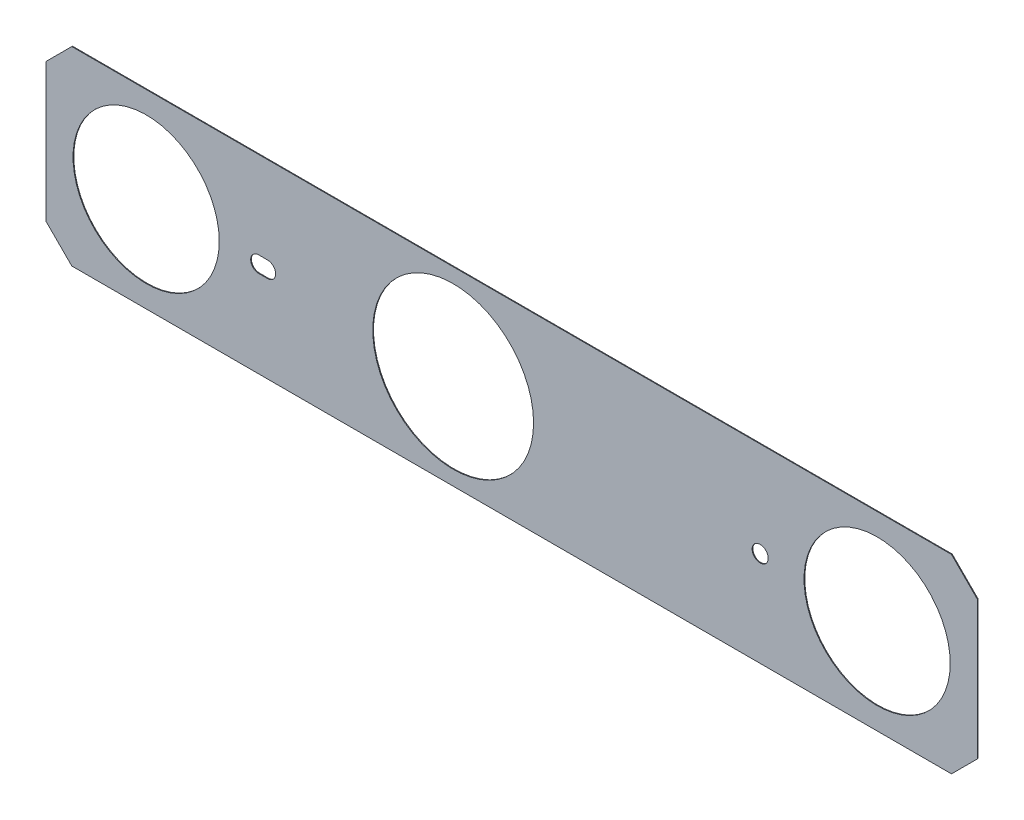
ISO-10303-21;
HEADER;
FILE_DESCRIPTION(('STEP AP214'),'2;1');
FILE_NAME('part.step','',(''),(''),'','','');
FILE_SCHEMA(('AUTOMOTIVE_DESIGN { 1 0 10303 214 1 1 1 1 }'));
ENDSEC;
DATA;
#1=APPLICATION_CONTEXT('core data for automotive mechanical design processes');
#2=APPLICATION_PROTOCOL_DEFINITION('international standard','automotive_design',2000,#1);
#3=PRODUCT_CONTEXT('',#1,'mechanical');
#4=PRODUCT('Part','Part','',(#3));
#5=PRODUCT_RELATED_PRODUCT_CATEGORY('part','',(#4));
#6=PRODUCT_DEFINITION_FORMATION('','',#4);
#7=PRODUCT_DEFINITION_CONTEXT('part definition',#1,'design');
#8=PRODUCT_DEFINITION('design','',#6,#7);
#9=PRODUCT_DEFINITION_SHAPE('','',#8);
#10=(LENGTH_UNIT() NAMED_UNIT(*) SI_UNIT(.MILLI.,.METRE.));
#11=(NAMED_UNIT(*) PLANE_ANGLE_UNIT() SI_UNIT($,.RADIAN.));
#12=(NAMED_UNIT(*) SI_UNIT($,.STERADIAN.) SOLID_ANGLE_UNIT());
#13=UNCERTAINTY_MEASURE_WITH_UNIT(LENGTH_MEASURE(1.E-05),#10,'distance_accuracy_value','');
#14=(GEOMETRIC_REPRESENTATION_CONTEXT(3) GLOBAL_UNCERTAINTY_ASSIGNED_CONTEXT((#13)) GLOBAL_UNIT_ASSIGNED_CONTEXT((#10,
#11,#12)) REPRESENTATION_CONTEXT('',''));
#15=CARTESIAN_POINT('',(0.,0.,0.));
#16=DIRECTION('',(0.,0.,1.));
#17=DIRECTION('',(1.,0.,0.));
#18=AXIS2_PLACEMENT_3D('',#15,#16,#17);
#19=CARTESIAN_POINT('',(0.,0.,-3.02));
#20=DIRECTION('',(0.,0.,1.));
#21=DIRECTION('',(1.,0.,0.));
#22=AXIS2_PLACEMENT_3D('',#19,#20,#21);
#23=PLANE('',#22);
#24=CARTESIAN_POINT('',(-24.19204055372,0.,-3.02));
#25=DIRECTION('',(0.,0.,1.));
#26=DIRECTION('',(1.,0.,0.));
#27=AXIS2_PLACEMENT_3D('',#24,#25,#26);
#28=CIRCLE('',#27,0.55);
#29=CARTESIAN_POINT('',(-24.19204055372,-0.55,-3.02));
#30=VERTEX_POINT('',#29);
#31=CARTESIAN_POINT('',(-24.19204055372,0.55,-3.02));
#32=VERTEX_POINT('',#31);
#33=EDGE_CURVE('E86',#30,#32,#28,.T.);
#34=ORIENTED_EDGE('',*,*,#33,.T.);
#35=DIRECTION('',(1.,0.,0.));
#36=VECTOR('',#35,1.);
#37=CARTESIAN_POINT('',(-24.19204055372,0.55,-3.02));
#38=LINE('',#37,#36);
#39=CARTESIAN_POINT('',(-24.8,0.55,-3.02));
#40=VERTEX_POINT('',#39);
#41=EDGE_CURVE('E67',#32,#40,#38,.F.);
#42=ORIENTED_EDGE('',*,*,#41,.T.);
#43=CARTESIAN_POINT('',(-24.8,0.,-3.02));
#44=DIRECTION('',(0.,0.,1.));
#45=DIRECTION('',(1.,0.,0.));
#46=AXIS2_PLACEMENT_3D('',#43,#44,#45);
#47=CIRCLE('',#46,0.55);
#48=CARTESIAN_POINT('',(-24.8,-0.55,-3.02));
#49=VERTEX_POINT('',#48);
#50=EDGE_CURVE('E60',#40,#49,#47,.T.);
#51=ORIENTED_EDGE('',*,*,#50,.T.);
#52=DIRECTION('',(1.,0.,0.));
#53=VECTOR('',#52,1.);
#54=CARTESIAN_POINT('',(-24.8,-0.55,-3.02));
#55=LINE('',#54,#53);
#56=EDGE_CURVE('E64',#49,#30,#55,.T.);
#57=ORIENTED_EDGE('',*,*,#56,.T.);
#58=EDGE_LOOP('',(#34,#42,#51,#57));
#59=FACE_BOUND('',#58,.T.);
#60=CARTESIAN_POINT('',(9.5,0.,-3.02));
#61=DIRECTION('',(0.,0.,1.));
#62=DIRECTION('',(1.,0.,0.));
#63=AXIS2_PLACEMENT_3D('',#60,#61,#62);
#64=CIRCLE('',#63,0.55);
#65=CARTESIAN_POINT('',(10.05,0.,-3.02));
#66=VERTEX_POINT('',#65);
#67=EDGE_CURVE('E71',#66,#66,#64,.T.);
#68=ORIENTED_EDGE('',*,*,#67,.T.);
#69=EDGE_LOOP('',(#68));
#70=FACE_BOUND('',#69,.T.);
#71=CARTESIAN_POINT('',(17.5,0.,-3.02));
#72=DIRECTION('',(0.,0.,1.));
#73=DIRECTION('',(1.,0.,0.));
#74=AXIS2_PLACEMENT_3D('',#71,#72,#73);
#75=CIRCLE('',#74,5.);
#76=CARTESIAN_POINT('',(22.5,0.,-3.02));
#77=VERTEX_POINT('',#76);
#78=EDGE_CURVE('E113',#77,#77,#75,.T.);
#79=ORIENTED_EDGE('',*,*,#78,.T.);
#80=EDGE_LOOP('',(#79));
#81=FACE_BOUND('',#80,.T.);
#82=CARTESIAN_POINT('',(-11.5,0.,-3.02));
#83=DIRECTION('',(0.,0.,1.));
#84=DIRECTION('',(1.,0.,0.));
#85=AXIS2_PLACEMENT_3D('',#82,#83,#84);
#86=CIRCLE('',#85,5.5);
#87=CARTESIAN_POINT('',(-6.,0.,-3.02));
#88=VERTEX_POINT('',#87);
#89=EDGE_CURVE('E115',#88,#88,#86,.T.);
#90=ORIENTED_EDGE('',*,*,#89,.T.);
#91=EDGE_LOOP('',(#90));
#92=FACE_BOUND('',#91,.T.);
#93=CARTESIAN_POINT('',(-32.5,0.,-3.02));
#94=DIRECTION('',(0.,0.,1.));
#95=DIRECTION('',(1.,0.,0.));
#96=AXIS2_PLACEMENT_3D('',#93,#94,#95);
#97=CIRCLE('',#96,5.);
#98=CARTESIAN_POINT('',(-27.5,0.,-3.02));
#99=VERTEX_POINT('',#98);
#100=EDGE_CURVE('E20',#99,#99,#97,.T.);
#101=ORIENTED_EDGE('',*,*,#100,.T.);
#102=EDGE_LOOP('',(#101));
#103=FACE_BOUND('',#102,.T.);
#104=DIRECTION('',(0.707106781186548,0.707106781186548,0.));
#105=VECTOR('',#104,1.);
#106=CARTESIAN_POINT('',(22.58478643763,-6.5,-3.02));
#107=LINE('',#106,#105);
#108=CARTESIAN_POINT('',(22.5847864376303,-6.49999999999975,-3.02));
#109=VERTEX_POINT('',#108);
#110=CARTESIAN_POINT('',(24.3490000000005,-4.7357864376285,-3.02));
#111=VERTEX_POINT('',#110);
#112=EDGE_CURVE('E142',#109,#111,#107,.T.);
#113=ORIENTED_EDGE('',*,*,#112,.F.);
#114=DIRECTION('',(1.,0.,0.));
#115=VECTOR('',#114,1.);
#116=CARTESIAN_POINT('',(-37.58678643763,-6.5,-3.02));
#117=LINE('',#116,#115);
#118=CARTESIAN_POINT('',(-37.5867864376295,-6.49999999999875,-3.02));
#119=VERTEX_POINT('',#118);
#120=EDGE_CURVE('E148',#119,#109,#117,.T.);
#121=ORIENTED_EDGE('',*,*,#120,.F.);
#122=DIRECTION('',(0.707106781186548,-0.707106781186548,0.));
#123=VECTOR('',#122,1.);
#124=CARTESIAN_POINT('',(-39.351,-4.735786437627,-3.02));
#125=LINE('',#124,#123);
#126=CARTESIAN_POINT('',(-39.351,-4.735786437627,-3.02));
#127=VERTEX_POINT('',#126);
#128=EDGE_CURVE('E154',#127,#119,#125,.T.);
#129=ORIENTED_EDGE('',*,*,#128,.F.);
#130=DIRECTION('',(0.,1.,0.));
#131=VECTOR('',#130,1.);
#132=CARTESIAN_POINT('',(-39.351,4.735786437627,-3.02));
#133=LINE('',#132,#131);
#134=CARTESIAN_POINT('',(-39.3510000000002,4.73578643762925,-3.02));
#135=VERTEX_POINT('',#134);
#136=EDGE_CURVE('E160',#135,#127,#133,.F.);
#137=ORIENTED_EDGE('',*,*,#136,.F.);
#138=DIRECTION('',(-0.707106781186548,-0.707106781186548,0.));
#139=VECTOR('',#138,1.);
#140=CARTESIAN_POINT('',(-37.58678643763,6.5,-3.02));
#141=LINE('',#140,#139);
#142=CARTESIAN_POINT('',(-37.5867864376303,6.49999999999975,-3.02));
#143=VERTEX_POINT('',#142);
#144=EDGE_CURVE('E166',#143,#135,#141,.T.);
#145=ORIENTED_EDGE('',*,*,#144,.F.);
#146=DIRECTION('',(1.,0.,0.));
#147=VECTOR('',#146,1.);
#148=CARTESIAN_POINT('',(22.58478643763,6.5,-3.02));
#149=LINE('',#148,#147);
#150=CARTESIAN_POINT('',(22.5847864376298,6.49999999999925,-3.02));
#151=VERTEX_POINT('',#150);
#152=EDGE_CURVE('E90',#151,#143,#149,.F.);
#153=ORIENTED_EDGE('',*,*,#152,.F.);
#154=DIRECTION('',(-0.707106781186548,0.707106781186548,0.));
#155=VECTOR('',#154,1.);
#156=CARTESIAN_POINT('',(24.349,4.735786437627,-3.02));
#157=LINE('',#156,#155);
#158=CARTESIAN_POINT('',(24.349,4.735786437627,-3.02));
#159=VERTEX_POINT('',#158);
#160=EDGE_CURVE('E120',#159,#151,#157,.T.);
#161=ORIENTED_EDGE('',*,*,#160,.F.);
#162=DIRECTION('',(0.,1.,0.));
#163=VECTOR('',#162,1.);
#164=CARTESIAN_POINT('',(24.349,-4.735786437627,-3.02));
#165=LINE('',#164,#163);
#166=EDGE_CURVE('E136',#111,#159,#165,.T.);
#167=ORIENTED_EDGE('',*,*,#166,.F.);
#168=EDGE_LOOP('',(#113,#121,#129,#137,#145,#153,#161,#167));
#169=FACE_BOUND('',#168,.T.);
#170=ADVANCED_FACE('F17',(#59,#70,#81,#92,#103,#169),#23,.F.);
#171=CARTESIAN_POINT('',(22.58478643763,6.5,-3.02));
#172=DIRECTION('',(0.,1.,0.));
#173=DIRECTION('',(0.,0.,1.));
#174=AXIS2_PLACEMENT_3D('',#171,#172,#173);
#175=PLANE('',#174);
#176=DIRECTION('',(0.,0.,1.));
#177=VECTOR('',#176,1.);
#178=CARTESIAN_POINT('',(22.584786437629,6.499999999998,-3.02));
#179=LINE('',#178,#177);
#180=CARTESIAN_POINT('',(22.5847864376297,6.49999999999925,-2.97));
#181=VERTEX_POINT('',#180);
#182=EDGE_CURVE('E131',#151,#181,#179,.T.);
#183=ORIENTED_EDGE('',*,*,#182,.F.);
#184=ORIENTED_EDGE('',*,*,#152,.T.);
#185=DIRECTION('',(0.,0.,1.));
#186=VECTOR('',#185,1.);
#187=CARTESIAN_POINT('',(-37.58678643763,6.5,-3.02));
#188=LINE('',#187,#186);
#189=CARTESIAN_POINT('',(-37.5867864376303,6.49999999999975,-2.97));
#190=VERTEX_POINT('',#189);
#191=EDGE_CURVE('E168',#190,#143,#188,.F.);
#192=ORIENTED_EDGE('',*,*,#191,.F.);
#193=DIRECTION('',(1.,0.,0.));
#194=VECTOR('',#193,1.);
#195=CARTESIAN_POINT('',(0.,6.499999999999,-2.97));
#196=LINE('',#195,#194);
#197=EDGE_CURVE('E79',#181,#190,#196,.F.);
#198=ORIENTED_EDGE('',*,*,#197,.F.);
#199=EDGE_LOOP('',(#183,#184,#192,#198));
#200=FACE_BOUND('',#199,.T.);
#201=ADVANCED_FACE('F178',(#200),#175,.T.);
#202=CARTESIAN_POINT('',(-37.58678643763,6.5,-3.02));
#203=DIRECTION('',(-0.707106781186548,0.707106781186548,0.));
#204=DIRECTION('',(-0.707106781186548,-0.707106781186548,0.));
#205=AXIS2_PLACEMENT_3D('',#202,#203,#204);
#206=PLANE('',#205);
#207=ORIENTED_EDGE('',*,*,#191,.T.);
#208=ORIENTED_EDGE('',*,*,#144,.T.);
#209=DIRECTION('',(0.,0.,1.));
#210=VECTOR('',#209,1.);
#211=CARTESIAN_POINT('',(-39.351,4.735786437629,-3.02));
#212=LINE('',#211,#210);
#213=CARTESIAN_POINT('',(-39.3510000000002,4.73578643762925,-2.97));
#214=VERTEX_POINT('',#213);
#215=EDGE_CURVE('E163',#214,#135,#212,.F.);
#216=ORIENTED_EDGE('',*,*,#215,.F.);
#217=DIRECTION('',(-0.707106781186345,-0.70710678118675,0.));
#218=VECTOR('',#217,1.);
#219=CARTESIAN_POINT('',(-37.58678643763,6.5,-2.97));
#220=LINE('',#219,#218);
#221=EDGE_CURVE('E247',#190,#214,#220,.T.);
#222=ORIENTED_EDGE('',*,*,#221,.F.);
#223=EDGE_LOOP('',(#207,#208,#216,#222));
#224=FACE_BOUND('',#223,.T.);
#225=ADVANCED_FACE('F187',(#224),#206,.T.);
#226=CARTESIAN_POINT('',(-39.351,4.735786437627,-3.02));
#227=DIRECTION('',(-1.,0.,0.));
#228=DIRECTION('',(0.,0.,1.));
#229=AXIS2_PLACEMENT_3D('',#226,#227,#228);
#230=PLANE('',#229);
#231=ORIENTED_EDGE('',*,*,#215,.T.);
#232=ORIENTED_EDGE('',*,*,#136,.T.);
#233=DIRECTION('',(0.,0.,1.));
#234=VECTOR('',#233,1.);
#235=CARTESIAN_POINT('',(-39.351,-4.735786437627,-3.02));
#236=LINE('',#235,#234);
#237=CARTESIAN_POINT('',(-39.351,-4.735786437627,-2.97));
#238=VERTEX_POINT('',#237);
#239=EDGE_CURVE('E157',#238,#127,#236,.F.);
#240=ORIENTED_EDGE('',*,*,#239,.F.);
#241=DIRECTION('',(0.,1.,0.));
#242=VECTOR('',#241,1.);
#243=CARTESIAN_POINT('',(-39.351,0.,-2.97));
#244=LINE('',#243,#242);
#245=EDGE_CURVE('E244',#214,#238,#244,.F.);
#246=ORIENTED_EDGE('',*,*,#245,.F.);
#247=EDGE_LOOP('',(#231,#232,#240,#246));
#248=FACE_BOUND('',#247,.T.);
#249=ADVANCED_FACE('F252',(#248),#230,.T.);
#250=CARTESIAN_POINT('',(-39.351,-4.735786437627,-3.02));
#251=DIRECTION('',(-0.707106781186548,-0.707106781186548,0.));
#252=DIRECTION('',(0.707106781186548,-0.707106781186548,0.));
#253=AXIS2_PLACEMENT_3D('',#250,#251,#252);
#254=PLANE('',#253);
#255=ORIENTED_EDGE('',*,*,#239,.T.);
#256=ORIENTED_EDGE('',*,*,#128,.T.);
#257=DIRECTION('',(0.,0.,-1.));
#258=VECTOR('',#257,1.);
#259=CARTESIAN_POINT('',(-37.58678643763,-6.5,-3.02));
#260=LINE('',#259,#258);
#261=CARTESIAN_POINT('',(-37.5867864376295,-6.49999999999875,-2.97));
#262=VERTEX_POINT('',#261);
#263=EDGE_CURVE('E151',#262,#119,#260,.T.);
#264=ORIENTED_EDGE('',*,*,#263,.F.);
#265=DIRECTION('',(0.707106781186145,-0.70710678118695,0.));
#266=VECTOR('',#265,1.);
#267=CARTESIAN_POINT('',(-39.351,-4.735786437627,-2.97));
#268=LINE('',#267,#266);
#269=EDGE_CURVE('E241',#238,#262,#268,.T.);
#270=ORIENTED_EDGE('',*,*,#269,.F.);
#271=EDGE_LOOP('',(#255,#256,#264,#270));
#272=FACE_BOUND('',#271,.T.);
#273=ADVANCED_FACE('F254',(#272),#254,.T.);
#274=CARTESIAN_POINT('',(-37.58678643763,-6.5,-3.02));
#275=DIRECTION('',(0.,-1.,0.));
#276=DIRECTION('',(0.,0.,-1.));
#277=AXIS2_PLACEMENT_3D('',#274,#275,#276);
#278=PLANE('',#277);
#279=ORIENTED_EDGE('',*,*,#263,.T.);
#280=ORIENTED_EDGE('',*,*,#120,.T.);
#281=DIRECTION('',(0.,0.,1.));
#282=VECTOR('',#281,1.);
#283=CARTESIAN_POINT('',(22.58478643763,-6.5,-3.02));
#284=LINE('',#283,#282);
#285=CARTESIAN_POINT('',(22.5847864376303,-6.49999999999975,-2.97));
#286=VERTEX_POINT('',#285);
#287=EDGE_CURVE('E145',#286,#109,#284,.F.);
#288=ORIENTED_EDGE('',*,*,#287,.F.);
#289=DIRECTION('',(1.,0.,0.));
#290=VECTOR('',#289,1.);
#291=CARTESIAN_POINT('',(0.,-6.499999999999,-2.97));
#292=LINE('',#291,#290);
#293=EDGE_CURVE('E236',#262,#286,#292,.T.);
#294=ORIENTED_EDGE('',*,*,#293,.F.);
#295=EDGE_LOOP('',(#279,#280,#288,#294));
#296=FACE_BOUND('',#295,.T.);
#297=ADVANCED_FACE('F258',(#296),#278,.T.);
#298=CARTESIAN_POINT('',(22.58478643763,-6.5,-3.02));
#299=DIRECTION('',(0.707106781186548,-0.707106781186548,0.));
#300=DIRECTION('',(0.707106781186548,0.707106781186548,0.));
#301=AXIS2_PLACEMENT_3D('',#298,#299,#300);
#302=PLANE('',#301);
#303=ORIENTED_EDGE('',*,*,#287,.T.);
#304=ORIENTED_EDGE('',*,*,#112,.T.);
#305=DIRECTION('',(0.,0.,-1.));
#306=VECTOR('',#305,1.);
#307=CARTESIAN_POINT('',(24.349,-4.735786437628,-3.02));
#308=LINE('',#307,#306);
#309=CARTESIAN_POINT('',(24.3490000000005,-4.7357864376285,-2.97));
#310=VERTEX_POINT('',#309);
#311=EDGE_CURVE('E139',#310,#111,#308,.T.);
#312=ORIENTED_EDGE('',*,*,#311,.F.);
#313=DIRECTION('',(0.707106781186146,0.707106781186949,0.));
#314=VECTOR('',#313,1.);
#315=CARTESIAN_POINT('',(22.58478643763,-6.5,-2.97));
#316=LINE('',#315,#314);
#317=EDGE_CURVE('E234',#286,#310,#316,.T.);
#318=ORIENTED_EDGE('',*,*,#317,.F.);
#319=EDGE_LOOP('',(#303,#304,#312,#318));
#320=FACE_BOUND('',#319,.T.);
#321=ADVANCED_FACE('F260',(#320),#302,.T.);
#322=CARTESIAN_POINT('',(24.349,-4.735786437627,-3.02));
#323=DIRECTION('',(1.,0.,0.));
#324=DIRECTION('',(0.,0.,-1.));
#325=AXIS2_PLACEMENT_3D('',#322,#323,#324);
#326=PLANE('',#325);
#327=ORIENTED_EDGE('',*,*,#311,.T.);
#328=ORIENTED_EDGE('',*,*,#166,.T.);
#329=DIRECTION('',(0.,0.,1.));
#330=VECTOR('',#329,1.);
#331=CARTESIAN_POINT('',(24.349,4.735786437627,-3.02));
#332=LINE('',#331,#330);
#333=CARTESIAN_POINT('',(24.349,4.735786437627,-2.97));
#334=VERTEX_POINT('',#333);
#335=EDGE_CURVE('E124',#334,#159,#332,.F.);
#336=ORIENTED_EDGE('',*,*,#335,.F.);
#337=DIRECTION('',(0.,1.,0.));
#338=VECTOR('',#337,1.);
#339=CARTESIAN_POINT('',(24.349,0.,-2.97));
#340=LINE('',#339,#338);
#341=EDGE_CURVE('E223',#310,#334,#340,.T.);
#342=ORIENTED_EDGE('',*,*,#341,.F.);
#343=EDGE_LOOP('',(#327,#328,#336,#342));
#344=FACE_BOUND('',#343,.T.);
#345=ADVANCED_FACE('F221',(#344),#326,.T.);
#346=CARTESIAN_POINT('',(24.349,4.735786437627,-3.02));
#347=DIRECTION('',(0.707106781186548,0.707106781186548,0.));
#348=DIRECTION('',(-0.707106781186548,0.707106781186548,0.));
#349=AXIS2_PLACEMENT_3D('',#346,#347,#348);
#350=PLANE('',#349);
#351=ORIENTED_EDGE('',*,*,#335,.T.);
#352=ORIENTED_EDGE('',*,*,#160,.T.);
#353=ORIENTED_EDGE('',*,*,#182,.T.);
#354=DIRECTION('',(-0.707106781186146,0.707106781186949,0.));
#355=VECTOR('',#354,1.);
#356=CARTESIAN_POINT('',(24.349,4.735786437627,-2.97));
#357=LINE('',#356,#355);
#358=EDGE_CURVE('E109',#334,#181,#357,.T.);
#359=ORIENTED_EDGE('',*,*,#358,.F.);
#360=EDGE_LOOP('',(#351,#352,#353,#359));
#361=FACE_BOUND('',#360,.T.);
#362=ADVANCED_FACE('F227',(#361),#350,.T.);
#363=CARTESIAN_POINT('',(-32.5,0.,-3.02));
#364=DIRECTION('',(0.,0.,1.));
#365=DIRECTION('',(1.,0.,0.));
#366=AXIS2_PLACEMENT_3D('',#363,#364,#365);
#367=CYLINDRICAL_SURFACE('',#366,5.);
#368=CARTESIAN_POINT('',(-32.5,0.,-2.97));
#369=DIRECTION('',(0.,0.,1.));
#370=DIRECTION('',(1.,0.,0.));
#371=AXIS2_PLACEMENT_3D('',#368,#369,#370);
#372=CIRCLE('',#371,5.);
#373=CARTESIAN_POINT('',(-27.5,0.,-2.97));
#374=VERTEX_POINT('',#373);
#375=EDGE_CURVE('E106',#374,#374,#372,.F.);
#376=ORIENTED_EDGE('',*,*,#375,.F.);
#377=EDGE_LOOP('',(#376));
#378=FACE_BOUND('',#377,.T.);
#379=ORIENTED_EDGE('',*,*,#100,.F.);
#380=EDGE_LOOP('',(#379));
#381=FACE_BOUND('',#380,.T.);
#382=ADVANCED_FACE('F299',(#378,#381),#367,.F.);
#383=CARTESIAN_POINT('',(-11.5,0.,-3.02));
#384=DIRECTION('',(0.,0.,1.));
#385=DIRECTION('',(1.,0.,0.));
#386=AXIS2_PLACEMENT_3D('',#383,#384,#385);
#387=CYLINDRICAL_SURFACE('',#386,5.5);
#388=CARTESIAN_POINT('',(-11.5,0.,-2.97));
#389=DIRECTION('',(0.,0.,1.));
#390=DIRECTION('',(1.,0.,0.));
#391=AXIS2_PLACEMENT_3D('',#388,#389,#390);
#392=CIRCLE('',#391,5.5);
#393=CARTESIAN_POINT('',(-6.,0.,-2.97));
#394=VERTEX_POINT('',#393);
#395=EDGE_CURVE('E103',#394,#394,#392,.F.);
#396=ORIENTED_EDGE('',*,*,#395,.F.);
#397=EDGE_LOOP('',(#396));
#398=FACE_BOUND('',#397,.T.);
#399=ORIENTED_EDGE('',*,*,#89,.F.);
#400=EDGE_LOOP('',(#399));
#401=FACE_BOUND('',#400,.T.);
#402=ADVANCED_FACE('F295',(#398,#401),#387,.F.);
#403=CARTESIAN_POINT('',(17.5,0.,-3.02));
#404=DIRECTION('',(0.,0.,1.));
#405=DIRECTION('',(1.,0.,0.));
#406=AXIS2_PLACEMENT_3D('',#403,#404,#405);
#407=CYLINDRICAL_SURFACE('',#406,5.);
#408=CARTESIAN_POINT('',(17.5,0.,-2.97));
#409=DIRECTION('',(0.,0.,1.));
#410=DIRECTION('',(1.,0.,0.));
#411=AXIS2_PLACEMENT_3D('',#408,#409,#410);
#412=CIRCLE('',#411,5.);
#413=CARTESIAN_POINT('',(22.5,0.,-2.97));
#414=VERTEX_POINT('',#413);
#415=EDGE_CURVE('E100',#414,#414,#412,.F.);
#416=ORIENTED_EDGE('',*,*,#415,.F.);
#417=EDGE_LOOP('',(#416));
#418=FACE_BOUND('',#417,.T.);
#419=ORIENTED_EDGE('',*,*,#78,.F.);
#420=EDGE_LOOP('',(#419));
#421=FACE_BOUND('',#420,.T.);
#422=ADVANCED_FACE('F291',(#418,#421),#407,.F.);
#423=CARTESIAN_POINT('',(9.5,0.,-2.97));
#424=DIRECTION('',(0.,0.,1.));
#425=DIRECTION('',(1.,0.,0.));
#426=AXIS2_PLACEMENT_3D('',#423,#424,#425);
#427=CYLINDRICAL_SURFACE('',#426,0.55);
#428=CARTESIAN_POINT('',(9.5,0.,-2.97));
#429=DIRECTION('',(0.,0.,1.));
#430=DIRECTION('',(1.,0.,0.));
#431=AXIS2_PLACEMENT_3D('',#428,#429,#430);
#432=CIRCLE('',#431,0.55);
#433=CARTESIAN_POINT('',(10.05,0.,-2.97));
#434=VERTEX_POINT('',#433);
#435=EDGE_CURVE('E97',#434,#434,#432,.F.);
#436=ORIENTED_EDGE('',*,*,#435,.F.);
#437=EDGE_LOOP('',(#436));
#438=FACE_BOUND('',#437,.T.);
#439=ORIENTED_EDGE('',*,*,#67,.F.);
#440=EDGE_LOOP('',(#439));
#441=FACE_BOUND('',#440,.T.);
#442=ADVANCED_FACE('F288',(#438,#441),#427,.F.);
#443=CARTESIAN_POINT('',(-24.8,0.,-2.97));
#444=DIRECTION('',(0.,0.,1.));
#445=DIRECTION('',(1.,0.,0.));
#446=AXIS2_PLACEMENT_3D('',#443,#444,#445);
#447=CYLINDRICAL_SURFACE('',#446,0.55);
#448=DIRECTION('',(0.,0.,1.));
#449=VECTOR('',#448,1.);
#450=CARTESIAN_POINT('',(-24.8,0.55,-2.97));
#451=LINE('',#450,#449);
#452=CARTESIAN_POINT('',(-24.8,0.55,-2.97));
#453=VERTEX_POINT('',#452);
#454=EDGE_CURVE('E93',#40,#453,#451,.T.);
#455=ORIENTED_EDGE('',*,*,#454,.T.);
#456=CARTESIAN_POINT('',(-24.8,0.,-2.97));
#457=DIRECTION('',(0.,0.,1.));
#458=DIRECTION('',(1.,0.,0.));
#459=AXIS2_PLACEMENT_3D('',#456,#457,#458);
#460=CIRCLE('',#459,0.55);
#461=CARTESIAN_POINT('',(-24.8,-0.55,-2.97));
#462=VERTEX_POINT('',#461);
#463=EDGE_CURVE('E76',#462,#453,#460,.F.);
#464=ORIENTED_EDGE('',*,*,#463,.F.);
#465=DIRECTION('',(0.,0.,-1.));
#466=VECTOR('',#465,1.);
#467=CARTESIAN_POINT('',(-24.8,-0.55,-2.97));
#468=LINE('',#467,#466);
#469=EDGE_CURVE('E74',#462,#49,#468,.T.);
#470=ORIENTED_EDGE('',*,*,#469,.T.);
#471=ORIENTED_EDGE('',*,*,#50,.F.);
#472=EDGE_LOOP('',(#455,#464,#470,#471));
#473=FACE_BOUND('',#472,.T.);
#474=ADVANCED_FACE('F75',(#473),#447,.F.);
#475=CARTESIAN_POINT('',(-24.19204055372,0.55,-2.97));
#476=DIRECTION('',(0.,1.,0.));
#477=DIRECTION('',(0.,0.,1.));
#478=AXIS2_PLACEMENT_3D('',#475,#476,#477);
#479=PLANE('',#478);
#480=DIRECTION('',(1.,0.,0.));
#481=VECTOR('',#480,1.);
#482=CARTESIAN_POINT('',(0.,0.55,-2.97));
#483=LINE('',#482,#481);
#484=CARTESIAN_POINT('',(-24.19204055372,0.55,-2.97));
#485=VERTEX_POINT('',#484);
#486=EDGE_CURVE('E95',#453,#485,#483,.T.);
#487=ORIENTED_EDGE('',*,*,#486,.F.);
#488=ORIENTED_EDGE('',*,*,#454,.F.);
#489=ORIENTED_EDGE('',*,*,#41,.F.);
#490=DIRECTION('',(0.,0.,1.));
#491=VECTOR('',#490,1.);
#492=CARTESIAN_POINT('',(-24.19204055372,0.55,-2.97));
#493=LINE('',#492,#491);
#494=EDGE_CURVE('E83',#32,#485,#493,.T.);
#495=ORIENTED_EDGE('',*,*,#494,.T.);
#496=EDGE_LOOP('',(#487,#488,#489,#495));
#497=FACE_BOUND('',#496,.T.);
#498=ADVANCED_FACE('F281',(#497),#479,.F.);
#499=CARTESIAN_POINT('',(-24.19204055372,0.,-2.97));
#500=DIRECTION('',(0.,0.,1.));
#501=DIRECTION('',(1.,0.,0.));
#502=AXIS2_PLACEMENT_3D('',#499,#500,#501);
#503=CYLINDRICAL_SURFACE('',#502,0.55);
#504=DIRECTION('',(0.,0.,-1.));
#505=VECTOR('',#504,1.);
#506=CARTESIAN_POINT('',(-24.19204055372,-0.55,-2.97));
#507=LINE('',#506,#505);
#508=CARTESIAN_POINT('',(-24.19204055372,-0.55,-2.97));
#509=VERTEX_POINT('',#508);
#510=EDGE_CURVE('E80',#30,#509,#507,.F.);
#511=ORIENTED_EDGE('',*,*,#510,.T.);
#512=CARTESIAN_POINT('',(-24.19204055372,0.,-2.97));
#513=DIRECTION('',(0.,0.,1.));
#514=DIRECTION('',(1.,0.,0.));
#515=AXIS2_PLACEMENT_3D('',#512,#513,#514);
#516=CIRCLE('',#515,0.55);
#517=EDGE_CURVE('E26',#485,#509,#516,.F.);
#518=ORIENTED_EDGE('',*,*,#517,.F.);
#519=ORIENTED_EDGE('',*,*,#494,.F.);
#520=ORIENTED_EDGE('',*,*,#33,.F.);
#521=EDGE_LOOP('',(#511,#518,#519,#520));
#522=FACE_BOUND('',#521,.T.);
#523=ADVANCED_FACE('F275',(#522),#503,.F.);
#524=CARTESIAN_POINT('',(-24.8,-0.55,-2.97));
#525=DIRECTION('',(0.,-1.,0.));
#526=DIRECTION('',(0.,0.,-1.));
#527=AXIS2_PLACEMENT_3D('',#524,#525,#526);
#528=PLANE('',#527);
#529=DIRECTION('',(1.,0.,0.));
#530=VECTOR('',#529,1.);
#531=CARTESIAN_POINT('',(0.,-0.55,-2.97));
#532=LINE('',#531,#530);
#533=EDGE_CURVE('E11',#509,#462,#532,.F.);
#534=ORIENTED_EDGE('',*,*,#533,.F.);
#535=ORIENTED_EDGE('',*,*,#510,.F.);
#536=ORIENTED_EDGE('',*,*,#56,.F.);
#537=ORIENTED_EDGE('',*,*,#469,.F.);
#538=EDGE_LOOP('',(#534,#535,#536,#537));
#539=FACE_BOUND('',#538,.T.);
#540=ADVANCED_FACE('F82',(#539),#528,.F.);
#541=CARTESIAN_POINT('',(0.,0.,-2.97));
#542=DIRECTION('',(0.,0.,1.));
#543=DIRECTION('',(1.,0.,0.));
#544=AXIS2_PLACEMENT_3D('',#541,#542,#543);
#545=PLANE('',#544);
#546=ORIENTED_EDGE('',*,*,#517,.T.);
#547=ORIENTED_EDGE('',*,*,#533,.T.);
#548=ORIENTED_EDGE('',*,*,#463,.T.);
#549=ORIENTED_EDGE('',*,*,#486,.T.);
#550=EDGE_LOOP('',(#546,#547,#548,#549));
#551=FACE_BOUND('',#550,.T.);
#552=ORIENTED_EDGE('',*,*,#435,.T.);
#553=EDGE_LOOP('',(#552));
#554=FACE_BOUND('',#553,.T.);
#555=ORIENTED_EDGE('',*,*,#415,.T.);
#556=EDGE_LOOP('',(#555));
#557=FACE_BOUND('',#556,.T.);
#558=ORIENTED_EDGE('',*,*,#395,.T.);
#559=EDGE_LOOP('',(#558));
#560=FACE_BOUND('',#559,.T.);
#561=ORIENTED_EDGE('',*,*,#375,.T.);
#562=EDGE_LOOP('',(#561));
#563=FACE_BOUND('',#562,.T.);
#564=ORIENTED_EDGE('',*,*,#341,.T.);
#565=ORIENTED_EDGE('',*,*,#358,.T.);
#566=ORIENTED_EDGE('',*,*,#197,.T.);
#567=ORIENTED_EDGE('',*,*,#221,.T.);
#568=ORIENTED_EDGE('',*,*,#245,.T.);
#569=ORIENTED_EDGE('',*,*,#269,.T.);
#570=ORIENTED_EDGE('',*,*,#293,.T.);
#571=ORIENTED_EDGE('',*,*,#317,.T.);
#572=EDGE_LOOP('',(#564,#565,#566,#567,#568,#569,#570,#571));
#573=FACE_BOUND('',#572,.T.);
#574=ADVANCED_FACE('F231',(#551,#554,#557,#560,#563,#573),#545,.T.);
#575=CLOSED_SHELL('',(#170,#201,#225,#249,#273,#297,#321,#345,#362,#382,#402,#422,#442,#474,
#498,#523,#540,#574));
#576=MANIFOLD_SOLID_BREP('B1',#575);
#577=ADVANCED_BREP_SHAPE_REPRESENTATION('',(#18,#576),#14);
#578=SHAPE_DEFINITION_REPRESENTATION(#9,#577);
ENDSEC;
END-ISO-10303-21;
